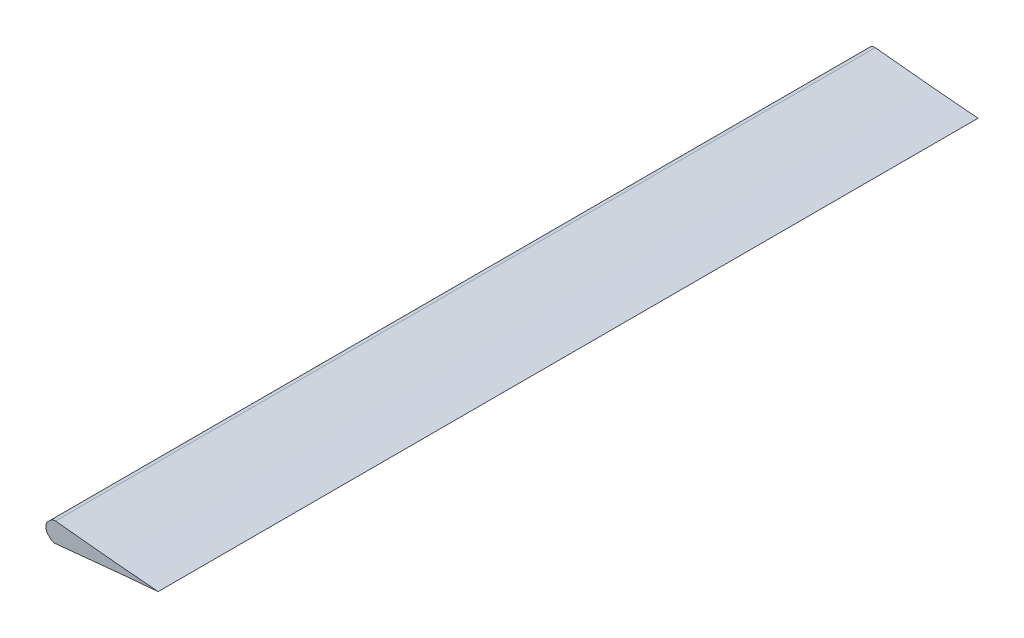
ISO-10303-21;
HEADER;
FILE_DESCRIPTION(('STEP AP214'),'2;1');
FILE_NAME('part.step','',(''),(''),'','','');
FILE_SCHEMA(('AUTOMOTIVE_DESIGN { 1 0 10303 214 1 1 1 1 }'));
ENDSEC;
DATA;
#1=APPLICATION_CONTEXT('core data for automotive mechanical design processes');
#2=APPLICATION_PROTOCOL_DEFINITION('international standard','automotive_design',2000,#1);
#3=PRODUCT_CONTEXT('',#1,'mechanical');
#4=PRODUCT('Part','Part','',(#3));
#5=PRODUCT_RELATED_PRODUCT_CATEGORY('part','',(#4));
#6=PRODUCT_DEFINITION_FORMATION('','',#4);
#7=PRODUCT_DEFINITION_CONTEXT('part definition',#1,'design');
#8=PRODUCT_DEFINITION('design','',#6,#7);
#9=PRODUCT_DEFINITION_SHAPE('','',#8);
#10=(LENGTH_UNIT() NAMED_UNIT(*) SI_UNIT(.MILLI.,.METRE.));
#11=(NAMED_UNIT(*) PLANE_ANGLE_UNIT() SI_UNIT($,.RADIAN.));
#12=(NAMED_UNIT(*) SI_UNIT($,.STERADIAN.) SOLID_ANGLE_UNIT());
#13=UNCERTAINTY_MEASURE_WITH_UNIT(LENGTH_MEASURE(1.E-05),#10,'distance_accuracy_value','');
#14=(GEOMETRIC_REPRESENTATION_CONTEXT(3) GLOBAL_UNCERTAINTY_ASSIGNED_CONTEXT((#13)) GLOBAL_UNIT_ASSIGNED_CONTEXT((#10,
#11,#12)) REPRESENTATION_CONTEXT('',''));
#15=CARTESIAN_POINT('',(0.,0.,0.));
#16=DIRECTION('',(0.,0.,1.));
#17=DIRECTION('',(1.,0.,0.));
#18=AXIS2_PLACEMENT_3D('',#15,#16,#17);
#19=CARTESIAN_POINT('',(234.188,0.,336.55));
#20=CARTESIAN_POINT('',(234.188,0.0155536867371754,336.55));
#21=CARTESIAN_POINT('',(232.462742238016,0.0763011183498608,336.55));
#22=CARTESIAN_POINT('',(230.745266477645,0.292527169730172,336.55));
#23=CARTESIAN_POINT('',(226.677132298683,0.685160998526905,336.55));
#24=CARTESIAN_POINT('',(221.753568546988,1.16400773563211,336.55));
#25=CARTESIAN_POINT('',(215.3729462007,1.68522549167521,336.55));
#26=CARTESIAN_POINT('',(207.860626626306,2.31925472415884,336.55));
#27=CARTESIAN_POINT('',(199.223228450697,3.07964727456537,336.55));
#28=CARTESIAN_POINT('',(189.624917000276,3.97906652208352,336.55));
#29=CARTESIAN_POINT('',(179.198535582012,5.00422639742074,336.55));
#30=CARTESIAN_POINT('',(168.099464270809,6.13682934498714,336.55));
#31=CARTESIAN_POINT('',(156.484959231023,7.35363328315477,336.55));
#32=CARTESIAN_POINT('',(144.512997428575,8.61174271170375,336.55));
#33=CARTESIAN_POINT('',(132.339974156296,9.87166744908778,336.55));
#34=CARTESIAN_POINT('',(120.116467894022,11.0852026217515,336.55));
#35=CARTESIAN_POINT('',(107.983552248755,12.1928122762789,336.55));
#36=CARTESIAN_POINT('',(96.0751169779638,13.1495005255012,336.55));
#37=CARTESIAN_POINT('',(84.511429242941,13.9022961995542,336.55));
#38=CARTESIAN_POINT('',(73.398930657052,14.404277626743,336.55));
#39=CARTESIAN_POINT('',(62.8303659193409,14.6175439004536,336.55));
#40=CARTESIAN_POINT('',(52.8907087007552,14.5288992131145,336.55));
#41=CARTESIAN_POINT('',(43.6527012524977,14.1187806479766,336.55));
#42=CARTESIAN_POINT('',(35.1768696170707,13.3806643516629,336.55));
#43=CARTESIAN_POINT('',(27.5098277844315,12.3176310606149,336.55));
#44=CARTESIAN_POINT('',(20.6924190451798,10.9652625561185,336.55));
#45=CARTESIAN_POINT('',(14.7650412799613,9.38991481063824,336.55));
#46=CARTESIAN_POINT('',(9.76935554134457,7.64375319719279,336.55));
#47=CARTESIAN_POINT('',(5.74944347020792,5.79620776104708,336.55));
#48=CARTESIAN_POINT('',(2.72813684802174,3.87076506472146,336.55));
#49=CARTESIAN_POINT('',(0.75513838257183,2.06686495836958,336.55));
#50=CARTESIAN_POINT('',(-0.307002000670747,0.,336.55));
#51=CARTESIAN_POINT('',(0.75513838257173,-2.06686495836939,336.55));
#52=CARTESIAN_POINT('',(2.72813684802176,-3.8707650647214,336.55));
#53=CARTESIAN_POINT('',(5.74944347020787,-5.7962077610469,336.55));
#54=CARTESIAN_POINT('',(9.76935554134459,-7.64375319719272,336.55));
#55=CARTESIAN_POINT('',(14.7650412799613,-9.38991481063812,336.55));
#56=CARTESIAN_POINT('',(20.6924190451799,-10.9652625561185,336.55));
#57=CARTESIAN_POINT('',(27.5098277844316,-12.3176310606148,336.55));
#58=CARTESIAN_POINT('',(35.1768696170708,-13.3806643516628,336.55));
#59=CARTESIAN_POINT('',(43.6527012524977,-14.1187806479765,336.55));
#60=CARTESIAN_POINT('',(52.8907087007555,-14.5288992131143,336.55));
#61=CARTESIAN_POINT('',(62.8303659193411,-14.6175439004534,336.55));
#62=CARTESIAN_POINT('',(73.3989306570518,-14.404277626743,336.55));
#63=CARTESIAN_POINT('',(84.511429242941,-13.902296199554,336.55));
#64=CARTESIAN_POINT('',(96.0751169779643,-13.1495005255013,336.55));
#65=CARTESIAN_POINT('',(107.983552248755,-12.1928122762789,336.55));
#66=CARTESIAN_POINT('',(120.116467894022,-11.0852026217515,336.55));
#67=CARTESIAN_POINT('',(132.339974156296,-9.87166744908783,336.55));
#68=CARTESIAN_POINT('',(144.512997428573,-8.61174271170374,336.55));
#69=CARTESIAN_POINT('',(156.484959231021,-7.35363328315465,336.55));
#70=CARTESIAN_POINT('',(168.099464270809,-6.13682934498709,336.55));
#71=CARTESIAN_POINT('',(179.198535582013,-5.00422639742061,336.55));
#72=CARTESIAN_POINT('',(189.624917000276,-3.97906652208336,336.55));
#73=CARTESIAN_POINT('',(199.223228450697,-3.07964727456527,336.55));
#74=CARTESIAN_POINT('',(207.860626626305,-2.31925472415887,336.55));
#75=CARTESIAN_POINT('',(215.372946200698,-1.68522549167517,336.55));
#76=CARTESIAN_POINT('',(221.753568546988,-1.16400773563204,336.55));
#77=CARTESIAN_POINT('',(226.677132298683,-0.685160998526885,336.55));
#78=CARTESIAN_POINT('',(230.745266477645,-0.292527169730231,336.55));
#79=CARTESIAN_POINT('',(232.462742238017,-0.0763011183498621,336.55));
#80=CARTESIAN_POINT('',(234.188,-0.0155536867371746,336.55));
#81=CARTESIAN_POINT('',(234.188,0.,336.55));
#82=B_SPLINE_CURVE_WITH_KNOTS('',3,(#19,#20,#21,#22,#23,#24,#25,#26,#27,#28,#29,#30,#31,#32,#33,
#34,#35,#36,#37,#38,#39,#40,#41,#42,#43,#44,#45,#46,#47,#48,#49,#50,#51,#52,#53,#54,#55,#56,#57,
#58,#59,#60,#61,#62,#63,#64,#65,#66,#67,#68,#69,#70,#71,#72,#73,#74,#75,#76,#77,#78,#79,#80,
#81),.UNSPECIFIED.,.T.,.F.,(4,1,1,1,1,1,1,1,1,1,1,1,1,1,1,1,1,1,1,1,1,1,1,1,1,1,1,1,1,1,1,1,1,1,
1,1,1,1,1,1,1,1,1,1,1,1,1,1,1,1,1,1,1,1,1,1,1,1,1,1,4),(0.,0.00172563476379416,
0.00673974483178372,0.0146959592279987,0.0253585857018278,0.0387010036513637,0.0546187297254756,
0.0728670420858862,0.0931742887105951,0.115236170244914,0.138726879481675,0.163314057854661,
0.188652327651034,0.214405506161386,0.24025088202969,0.265875120764067,0.29099755048633,
0.315354755940016,0.338722769262268,0.36092378194178,0.38180167100941,0.401202207986975,
0.419043051856454,0.435268910079612,0.449839477415212,0.462709567314331,0.473798585398369,
0.483060347557168,0.490497732750892,0.496136847068415,0.5,0.503863152931585,0.509502267249108,
0.516939652442832,0.526201414601631,0.537290432685669,0.550160522584788,0.564731089920388,
0.580956948143546,0.598797792013025,0.61819832899059,0.63907621805822,0.661277230737732,
0.684645244059984,0.70900244951367,0.734124879235933,0.75974911797031,0.785594493838614,
0.811347672348966,0.836685942145339,0.861273120518325,0.884763829755086,0.906825711289405,
0.927132957914114,0.945381270274525,0.961298996348636,0.974641414298172,0.985304040772001,
0.993260255168216,0.998274365236206,1.),.UNSPECIFIED.);
#83=DIRECTION('',(0.,0.,-1.));
#84=VECTOR('',#83,1.);
#85=SURFACE_OF_LINEAR_EXTRUSION('',#82,#84);
#86=CARTESIAN_POINT('',(234.188,0.,-336.55));
#87=CARTESIAN_POINT('',(234.188,0.0155536867371754,-336.55));
#88=CARTESIAN_POINT('',(232.462742238016,0.0763011183498608,-336.55));
#89=CARTESIAN_POINT('',(230.745266477645,0.292527169730172,-336.55));
#90=CARTESIAN_POINT('',(226.677132298683,0.685160998526905,-336.55));
#91=CARTESIAN_POINT('',(221.753568546988,1.16400773563211,-336.55));
#92=CARTESIAN_POINT('',(215.3729462007,1.68522549167521,-336.55));
#93=CARTESIAN_POINT('',(207.860626626306,2.31925472415884,-336.55));
#94=CARTESIAN_POINT('',(199.223228450697,3.07964727456537,-336.55));
#95=CARTESIAN_POINT('',(189.624917000276,3.97906652208352,-336.55));
#96=CARTESIAN_POINT('',(179.198535582012,5.00422639742074,-336.55));
#97=CARTESIAN_POINT('',(168.099464270809,6.13682934498714,-336.55));
#98=CARTESIAN_POINT('',(156.484959231023,7.35363328315477,-336.55));
#99=CARTESIAN_POINT('',(144.512997428575,8.61174271170375,-336.55));
#100=CARTESIAN_POINT('',(132.339974156296,9.87166744908778,-336.55));
#101=CARTESIAN_POINT('',(120.116467894022,11.0852026217515,-336.55));
#102=CARTESIAN_POINT('',(107.983552248755,12.1928122762789,-336.55));
#103=CARTESIAN_POINT('',(96.0751169779638,13.1495005255012,-336.55));
#104=CARTESIAN_POINT('',(84.511429242941,13.9022961995542,-336.55));
#105=CARTESIAN_POINT('',(73.398930657052,14.404277626743,-336.55));
#106=CARTESIAN_POINT('',(62.8303659193409,14.6175439004536,-336.55));
#107=CARTESIAN_POINT('',(52.8907087007552,14.5288992131145,-336.55));
#108=CARTESIAN_POINT('',(43.6527012524977,14.1187806479766,-336.55));
#109=CARTESIAN_POINT('',(35.1768696170707,13.3806643516629,-336.55));
#110=CARTESIAN_POINT('',(27.5098277844315,12.3176310606149,-336.55));
#111=CARTESIAN_POINT('',(20.6924190451798,10.9652625561185,-336.55));
#112=CARTESIAN_POINT('',(14.7650412799613,9.38991481063824,-336.55));
#113=CARTESIAN_POINT('',(9.76935554134457,7.64375319719279,-336.55));
#114=CARTESIAN_POINT('',(5.74944347020792,5.79620776104708,-336.55));
#115=CARTESIAN_POINT('',(2.72813684802174,3.87076506472146,-336.55));
#116=CARTESIAN_POINT('',(0.75513838257183,2.06686495836958,-336.55));
#117=CARTESIAN_POINT('',(-0.307002000670747,0.,-336.55));
#118=CARTESIAN_POINT('',(0.75513838257173,-2.06686495836939,-336.55));
#119=CARTESIAN_POINT('',(2.72813684802176,-3.8707650647214,-336.55));
#120=CARTESIAN_POINT('',(5.74944347020787,-5.7962077610469,-336.55));
#121=CARTESIAN_POINT('',(9.76935554134459,-7.64375319719272,-336.55));
#122=CARTESIAN_POINT('',(14.7650412799613,-9.38991481063812,-336.55));
#123=CARTESIAN_POINT('',(20.6924190451799,-10.9652625561185,-336.55));
#124=CARTESIAN_POINT('',(27.5098277844316,-12.3176310606148,-336.55));
#125=CARTESIAN_POINT('',(35.1768696170708,-13.3806643516628,-336.55));
#126=CARTESIAN_POINT('',(43.6527012524977,-14.1187806479765,-336.55));
#127=CARTESIAN_POINT('',(52.8907087007555,-14.5288992131143,-336.55));
#128=CARTESIAN_POINT('',(62.8303659193411,-14.6175439004534,-336.55));
#129=CARTESIAN_POINT('',(73.3989306570518,-14.404277626743,-336.55));
#130=CARTESIAN_POINT('',(84.511429242941,-13.902296199554,-336.55));
#131=CARTESIAN_POINT('',(96.0751169779643,-13.1495005255013,-336.55));
#132=CARTESIAN_POINT('',(107.983552248755,-12.1928122762789,-336.55));
#133=CARTESIAN_POINT('',(120.116467894022,-11.0852026217515,-336.55));
#134=CARTESIAN_POINT('',(132.339974156296,-9.87166744908783,-336.55));
#135=CARTESIAN_POINT('',(144.512997428573,-8.61174271170374,-336.55));
#136=CARTESIAN_POINT('',(156.484959231021,-7.35363328315465,-336.55));
#137=CARTESIAN_POINT('',(168.099464270809,-6.13682934498709,-336.55));
#138=CARTESIAN_POINT('',(179.198535582013,-5.00422639742061,-336.55));
#139=CARTESIAN_POINT('',(189.624917000276,-3.97906652208336,-336.55));
#140=CARTESIAN_POINT('',(199.223228450697,-3.07964727456527,-336.55));
#141=CARTESIAN_POINT('',(207.860626626305,-2.31925472415887,-336.55));
#142=CARTESIAN_POINT('',(215.372946200698,-1.68522549167517,-336.55));
#143=CARTESIAN_POINT('',(221.753568546988,-1.16400773563204,-336.55));
#144=CARTESIAN_POINT('',(226.677132298683,-0.685160998526885,-336.55));
#145=CARTESIAN_POINT('',(230.745266477645,-0.292527169730231,-336.55));
#146=CARTESIAN_POINT('',(232.462742238017,-0.0763011183498621,-336.55));
#147=CARTESIAN_POINT('',(234.188,-0.0155536867371746,-336.55));
#148=CARTESIAN_POINT('',(234.188,0.,-336.55));
#149=B_SPLINE_CURVE_WITH_KNOTS('',3,(#86,#87,#88,#89,#90,#91,#92,#93,#94,#95,#96,#97,#98,#99,
#100,#101,#102,#103,#104,#105,#106,#107,#108,#109,#110,#111,#112,#113,#114,#115,#116,#117,#118,
#119,#120,#121,#122,#123,#124,#125,#126,#127,#128,#129,#130,#131,#132,#133,#134,#135,#136,#137,
#138,#139,#140,#141,#142,#143,#144,#145,#146,#147,#148),.UNSPECIFIED.,.T.,.F.,(4,1,1,1,1,1,1,1,
1,1,1,1,1,1,1,1,1,1,1,1,1,1,1,1,1,1,1,1,1,1,1,1,1,1,1,1,1,1,1,1,1,1,1,1,1,1,1,1,1,1,1,1,1,1,1,1,
1,1,1,1,4),(0.,0.00172563476379416,0.00673974483178372,0.0146959592279987,0.0253585857018278,
0.0387010036513637,0.0546187297254756,0.0728670420858862,0.0931742887105951,0.115236170244914,
0.138726879481675,0.163314057854661,0.188652327651034,0.214405506161386,0.24025088202969,
0.265875120764067,0.29099755048633,0.315354755940016,0.338722769262268,0.36092378194178,
0.38180167100941,0.401202207986975,0.419043051856454,0.435268910079612,0.449839477415212,
0.462709567314331,0.473798585398369,0.483060347557168,0.490497732750892,0.496136847068415,0.5,
0.503863152931585,0.509502267249108,0.516939652442832,0.526201414601631,0.537290432685669,
0.550160522584788,0.564731089920388,0.580956948143546,0.598797792013025,0.61819832899059,
0.63907621805822,0.661277230737732,0.684645244059984,0.70900244951367,0.734124879235933,
0.75974911797031,0.785594493838614,0.811347672348966,0.836685942145339,0.861273120518325,
0.884763829755086,0.906825711289405,0.927132957914114,0.945381270274525,0.961298996348636,
0.974641414298172,0.985304040772001,0.993260255168216,0.998274365236206,1.),.UNSPECIFIED.);
#150=CARTESIAN_POINT('',(149.904539776558,-8.04466785803695,-336.55));
#151=VERTEX_POINT('',#150);
#152=CARTESIAN_POINT('',(149.88896674752,8.04630008600672,-336.55));
#153=VERTEX_POINT('',#152);
#154=EDGE_CURVE('E105',#151,#153,#149,.T.);
#155=ORIENTED_EDGE('',*,*,#154,.T.);
#156=DIRECTION('',(0.,0.,-1.));
#157=VECTOR('',#156,1.);
#158=CARTESIAN_POINT('',(149.88896674752,8.04630008600672,-336.55));
#159=LINE('',#158,#157);
#160=CARTESIAN_POINT('',(149.88896674752,8.04630008600672,336.55));
#161=VERTEX_POINT('',#160);
#162=EDGE_CURVE('E111',#153,#161,#159,.F.);
#163=ORIENTED_EDGE('',*,*,#162,.T.);
#164=CARTESIAN_POINT('',(149.904539776558,-8.04466785803695,336.55));
#165=VERTEX_POINT('',#164);
#166=EDGE_CURVE('E108',#165,#161,#82,.T.);
#167=ORIENTED_EDGE('',*,*,#166,.F.);
#168=DIRECTION('',(0.,0.,-1.));
#169=VECTOR('',#168,1.);
#170=CARTESIAN_POINT('',(149.904539776558,-8.04466785803694,336.55));
#171=LINE('',#170,#169);
#172=EDGE_CURVE('E102',#165,#151,#171,.T.);
#173=ORIENTED_EDGE('',*,*,#172,.T.);
#174=EDGE_LOOP('',(#155,#163,#167,#173));
#175=FACE_BOUND('',#174,.T.);
#176=ADVANCED_FACE('F36',(#175),#85,.F.);
#177=CARTESIAN_POINT('',(0.,0.,336.55));
#178=DIRECTION('',(0.,0.,-1.));
#179=DIRECTION('',(-1.,0.,0.));
#180=AXIS2_PLACEMENT_3D('',#177,#178,#179);
#181=PLANE('',#180);
#182=ORIENTED_EDGE('',*,*,#166,.T.);
#183=CARTESIAN_POINT('',(149.35942884864,2.99397491697312,336.55));
#184=DIRECTION('',(0.,0.,-1.));
#185=DIRECTION('',(-1.,0.,0.));
#186=AXIS2_PLACEMENT_3D('',#183,#184,#185);
#187=CIRCLE('',#186,5.08);
#188=CARTESIAN_POINT('',(145.767326400213,6.58607736540086,336.55));
#189=VERTEX_POINT('',#188);
#190=EDGE_CURVE('E197',#161,#189,#187,.F.);
#191=ORIENTED_EDGE('',*,*,#190,.T.);
#192=DIRECTION('',(0.707106781186557,0.707106781186539,0.));
#193=VECTOR('',#192,1.);
#194=CARTESIAN_POINT('',(69.590624517404,-69.5906245174058,336.55));
#195=LINE('',#194,#193);
#196=CARTESIAN_POINT('',(143.600897551572,4.41964851676048,336.55));
#197=VERTEX_POINT('',#196);
#198=EDGE_CURVE('E147',#197,#189,#195,.T.);
#199=ORIENTED_EDGE('',*,*,#198,.F.);
#200=CARTESIAN_POINT('',(147.193,0.827546068332755,336.55));
#201=DIRECTION('',(0.,0.,-1.));
#202=DIRECTION('',(-1.,0.,0.));
#203=AXIS2_PLACEMENT_3D('',#200,#201,#202);
#204=CIRCLE('',#203,5.08);
#205=CARTESIAN_POINT('',(142.113,0.827546068332715,336.55));
#206=VERTEX_POINT('',#205);
#207=EDGE_CURVE('E146',#197,#206,#204,.F.);
#208=ORIENTED_EDGE('',*,*,#207,.T.);
#209=DIRECTION('',(0.,1.,0.));
#210=VECTOR('',#209,1.);
#211=CARTESIAN_POINT('',(142.113,1.11318642939109E-12,336.55));
#212=LINE('',#211,#210);
#213=CARTESIAN_POINT('',(142.113,-0.810346053983728,336.55));
#214=VERTEX_POINT('',#213);
#215=EDGE_CURVE('E137',#214,#206,#212,.T.);
#216=ORIENTED_EDGE('',*,*,#215,.F.);
#217=CARTESIAN_POINT('',(147.193,-0.810346053983689,336.55));
#218=DIRECTION('',(0.,0.,-1.));
#219=DIRECTION('',(-1.,0.,0.));
#220=AXIS2_PLACEMENT_3D('',#217,#218,#219);
#221=CIRCLE('',#220,5.08);
#222=CARTESIAN_POINT('',(143.600897551572,-4.40244850241142,336.55));
#223=VERTEX_POINT('',#222);
#224=EDGE_CURVE('E143',#214,#223,#221,.F.);
#225=ORIENTED_EDGE('',*,*,#224,.T.);
#226=DIRECTION('',(0.707106781186561,-0.707106781186534,0.));
#227=VECTOR('',#226,1.);
#228=CARTESIAN_POINT('',(69.5992245245776,69.5992245245803,336.55));
#229=LINE('',#228,#227);
#230=CARTESIAN_POINT('',(145.782894683952,-6.58444563479155,336.55));
#231=VERTEX_POINT('',#230);
#232=EDGE_CURVE('E150',#223,#231,#229,.T.);
#233=ORIENTED_EDGE('',*,*,#232,.T.);
#234=CARTESIAN_POINT('',(149.37499713238,-2.9923431863638,336.55));
#235=DIRECTION('',(0.,0.,-1.));
#236=DIRECTION('',(-1.,0.,0.));
#237=AXIS2_PLACEMENT_3D('',#234,#235,#236);
#238=CIRCLE('',#237,5.08);
#239=EDGE_CURVE('E199',#231,#165,#238,.F.);
#240=ORIENTED_EDGE('',*,*,#239,.T.);
#241=EDGE_LOOP('',(#182,#191,#199,#208,#216,#225,#233,#240));
#242=FACE_BOUND('',#241,.T.);
#243=ADVANCED_FACE('F141',(#242),#181,.F.);
#244=CARTESIAN_POINT('',(0.,0.,-336.55));
#245=DIRECTION('',(0.,0.,-1.));
#246=DIRECTION('',(-1.,0.,0.));
#247=AXIS2_PLACEMENT_3D('',#244,#245,#246);
#248=PLANE('',#247);
#249=DIRECTION('',(0.707106781186557,0.707106781186539,0.));
#250=VECTOR('',#249,1.);
#251=CARTESIAN_POINT('',(69.590624517404,-69.5906245174058,-336.55));
#252=LINE('',#251,#250);
#253=CARTESIAN_POINT('',(143.600897551572,4.41964851676048,-336.55));
#254=VERTEX_POINT('',#253);
#255=CARTESIAN_POINT('',(145.767326400213,6.58607736540086,-336.55));
#256=VERTEX_POINT('',#255);
#257=EDGE_CURVE('E186',#254,#256,#252,.T.);
#258=ORIENTED_EDGE('',*,*,#257,.T.);
#259=CARTESIAN_POINT('',(149.35942884864,2.99397491697312,-336.55));
#260=DIRECTION('',(0.,0.,-1.));
#261=DIRECTION('',(-1.,0.,0.));
#262=AXIS2_PLACEMENT_3D('',#259,#260,#261);
#263=CIRCLE('',#262,5.08);
#264=EDGE_CURVE('E118',#256,#153,#263,.T.);
#265=ORIENTED_EDGE('',*,*,#264,.T.);
#266=ORIENTED_EDGE('',*,*,#154,.F.);
#267=CARTESIAN_POINT('',(149.37499713238,-2.9923431863638,-336.55));
#268=DIRECTION('',(0.,0.,-1.));
#269=DIRECTION('',(-1.,0.,0.));
#270=AXIS2_PLACEMENT_3D('',#267,#268,#269);
#271=CIRCLE('',#270,5.08);
#272=CARTESIAN_POINT('',(145.782894683952,-6.58444563479155,-336.55));
#273=VERTEX_POINT('',#272);
#274=EDGE_CURVE('E115',#151,#273,#271,.T.);
#275=ORIENTED_EDGE('',*,*,#274,.T.);
#276=DIRECTION('',(0.707106781186561,-0.707106781186534,0.));
#277=VECTOR('',#276,1.);
#278=CARTESIAN_POINT('',(69.5992245245776,69.5992245245803,-336.55));
#279=LINE('',#278,#277);
#280=CARTESIAN_POINT('',(143.600897551572,-4.40244850241142,-336.55));
#281=VERTEX_POINT('',#280);
#282=EDGE_CURVE('E119',#281,#273,#279,.T.);
#283=ORIENTED_EDGE('',*,*,#282,.F.);
#284=CARTESIAN_POINT('',(147.193,-0.810346053983689,-336.55));
#285=DIRECTION('',(0.,0.,-1.));
#286=DIRECTION('',(-1.,0.,0.));
#287=AXIS2_PLACEMENT_3D('',#284,#285,#286);
#288=CIRCLE('',#287,5.08);
#289=CARTESIAN_POINT('',(142.113,-0.810346053983728,-336.55));
#290=VERTEX_POINT('',#289);
#291=EDGE_CURVE('E56',#281,#290,#288,.T.);
#292=ORIENTED_EDGE('',*,*,#291,.T.);
#293=DIRECTION('',(0.,1.,0.));
#294=VECTOR('',#293,1.);
#295=CARTESIAN_POINT('',(142.113,1.11318642939109E-12,-336.55));
#296=LINE('',#295,#294);
#297=CARTESIAN_POINT('',(142.113,0.827546068332715,-336.55));
#298=VERTEX_POINT('',#297);
#299=EDGE_CURVE('E138',#290,#298,#296,.T.);
#300=ORIENTED_EDGE('',*,*,#299,.T.);
#301=CARTESIAN_POINT('',(147.193,0.827546068332755,-336.55));
#302=DIRECTION('',(0.,0.,-1.));
#303=DIRECTION('',(-1.,0.,0.));
#304=AXIS2_PLACEMENT_3D('',#301,#302,#303);
#305=CIRCLE('',#304,5.08);
#306=EDGE_CURVE('E125',#298,#254,#305,.T.);
#307=ORIENTED_EDGE('',*,*,#306,.T.);
#308=EDGE_LOOP('',(#258,#265,#266,#275,#283,#292,#300,#307));
#309=FACE_BOUND('',#308,.T.);
#310=ADVANCED_FACE('F114',(#309),#248,.T.);
#311=CARTESIAN_POINT('',(142.113,1.11318642939109E-12,-336.55));
#312=DIRECTION('',(1.,0.,0.));
#313=DIRECTION('',(0.,1.,0.));
#314=AXIS2_PLACEMENT_3D('',#311,#312,#313);
#315=PLANE('',#314);
#316=ORIENTED_EDGE('',*,*,#215,.T.);
#317=DIRECTION('',(0.,0.,1.));
#318=VECTOR('',#317,1.);
#319=CARTESIAN_POINT('',(142.113,0.827546068332715,-336.55));
#320=LINE('',#319,#318);
#321=EDGE_CURVE('E11',#206,#298,#320,.F.);
#322=ORIENTED_EDGE('',*,*,#321,.T.);
#323=ORIENTED_EDGE('',*,*,#299,.F.);
#324=DIRECTION('',(0.,0.,1.));
#325=VECTOR('',#324,1.);
#326=CARTESIAN_POINT('',(142.113,-0.810346053983728,336.55));
#327=LINE('',#326,#325);
#328=EDGE_CURVE('E44',#290,#214,#327,.T.);
#329=ORIENTED_EDGE('',*,*,#328,.T.);
#330=EDGE_LOOP('',(#316,#322,#323,#329));
#331=FACE_BOUND('',#330,.T.);
#332=ADVANCED_FACE('F136',(#331),#315,.F.);
#333=CARTESIAN_POINT('',(69.5992245245776,69.5992245245803,-336.55));
#334=DIRECTION('',(-0.707106781186534,-0.707106781186561,0.));
#335=DIRECTION('',(0.707106781186561,-0.707106781186534,0.));
#336=AXIS2_PLACEMENT_3D('',#333,#334,#335);
#337=PLANE('',#336);
#338=ORIENTED_EDGE('',*,*,#282,.T.);
#339=DIRECTION('',(0.,0.,1.));
#340=VECTOR('',#339,1.);
#341=CARTESIAN_POINT('',(145.782894683952,-6.58444563479153,336.55));
#342=LINE('',#341,#340);
#343=EDGE_CURVE('E124',#273,#231,#342,.T.);
#344=ORIENTED_EDGE('',*,*,#343,.T.);
#345=ORIENTED_EDGE('',*,*,#232,.F.);
#346=DIRECTION('',(0.,0.,1.));
#347=VECTOR('',#346,1.);
#348=CARTESIAN_POINT('',(143.600897551572,-4.40244850241142,-336.55));
#349=LINE('',#348,#347);
#350=EDGE_CURVE('E127',#223,#281,#349,.F.);
#351=ORIENTED_EDGE('',*,*,#350,.T.);
#352=EDGE_LOOP('',(#338,#344,#345,#351));
#353=FACE_BOUND('',#352,.T.);
#354=ADVANCED_FACE('F192',(#353),#337,.T.);
#355=CARTESIAN_POINT('',(69.590624517404,-69.5906245174058,-336.55));
#356=DIRECTION('',(0.707106781186539,-0.707106781186557,0.));
#357=DIRECTION('',(0.707106781186557,0.707106781186539,0.));
#358=AXIS2_PLACEMENT_3D('',#355,#356,#357);
#359=PLANE('',#358);
#360=ORIENTED_EDGE('',*,*,#198,.T.);
#361=DIRECTION('',(0.,0.,-1.));
#362=VECTOR('',#361,1.);
#363=CARTESIAN_POINT('',(145.767326400213,6.58607736540086,-336.55));
#364=LINE('',#363,#362);
#365=EDGE_CURVE('E189',#189,#256,#364,.T.);
#366=ORIENTED_EDGE('',*,*,#365,.T.);
#367=ORIENTED_EDGE('',*,*,#257,.F.);
#368=DIRECTION('',(0.,0.,1.));
#369=VECTOR('',#368,1.);
#370=CARTESIAN_POINT('',(143.600897551572,4.41964851676048,-336.55));
#371=LINE('',#370,#369);
#372=EDGE_CURVE('E184',#254,#197,#371,.T.);
#373=ORIENTED_EDGE('',*,*,#372,.T.);
#374=EDGE_LOOP('',(#360,#366,#367,#373));
#375=FACE_BOUND('',#374,.T.);
#376=ADVANCED_FACE('F172',(#375),#359,.F.);
#377=CARTESIAN_POINT('',(149.35942884864,2.99397491697312,0.));
#378=DIRECTION('',(0.,0.,-1.));
#379=DIRECTION('',(-1.,0.,0.));
#380=AXIS2_PLACEMENT_3D('',#377,#378,#379);
#381=CYLINDRICAL_SURFACE('',#380,5.08);
#382=ORIENTED_EDGE('',*,*,#264,.F.);
#383=ORIENTED_EDGE('',*,*,#365,.F.);
#384=ORIENTED_EDGE('',*,*,#190,.F.);
#385=ORIENTED_EDGE('',*,*,#162,.F.);
#386=EDGE_LOOP('',(#382,#383,#384,#385));
#387=FACE_BOUND('',#386,.T.);
#388=ADVANCED_FACE('F169',(#387),#381,.T.);
#389=CARTESIAN_POINT('',(149.37499713238,-2.9923431863638,0.));
#390=DIRECTION('',(0.,0.,-1.));
#391=DIRECTION('',(-1.,0.,0.));
#392=AXIS2_PLACEMENT_3D('',#389,#390,#391);
#393=CYLINDRICAL_SURFACE('',#392,5.08);
#394=ORIENTED_EDGE('',*,*,#274,.F.);
#395=ORIENTED_EDGE('',*,*,#172,.F.);
#396=ORIENTED_EDGE('',*,*,#239,.F.);
#397=ORIENTED_EDGE('',*,*,#343,.F.);
#398=EDGE_LOOP('',(#394,#395,#396,#397));
#399=FACE_BOUND('',#398,.T.);
#400=ADVANCED_FACE('F122',(#399),#393,.T.);
#401=CARTESIAN_POINT('',(147.193,0.827546068332755,-336.55));
#402=DIRECTION('',(0.,0.,1.));
#403=DIRECTION('',(1.,0.,0.));
#404=AXIS2_PLACEMENT_3D('',#401,#402,#403);
#405=CYLINDRICAL_SURFACE('',#404,5.08);
#406=ORIENTED_EDGE('',*,*,#306,.F.);
#407=ORIENTED_EDGE('',*,*,#321,.F.);
#408=ORIENTED_EDGE('',*,*,#207,.F.);
#409=ORIENTED_EDGE('',*,*,#372,.F.);
#410=EDGE_LOOP('',(#406,#407,#408,#409));
#411=FACE_BOUND('',#410,.T.);
#412=ADVANCED_FACE('F175',(#411),#405,.T.);
#413=CARTESIAN_POINT('',(147.193,-0.810346053983689,-336.55));
#414=DIRECTION('',(0.,0.,-1.));
#415=DIRECTION('',(-1.,0.,0.));
#416=AXIS2_PLACEMENT_3D('',#413,#414,#415);
#417=CYLINDRICAL_SURFACE('',#416,5.08);
#418=ORIENTED_EDGE('',*,*,#291,.F.);
#419=ORIENTED_EDGE('',*,*,#350,.F.);
#420=ORIENTED_EDGE('',*,*,#224,.F.);
#421=ORIENTED_EDGE('',*,*,#328,.F.);
#422=EDGE_LOOP('',(#418,#419,#420,#421));
#423=FACE_BOUND('',#422,.T.);
#424=ADVANCED_FACE('F38',(#423),#417,.T.);
#425=CLOSED_SHELL('',(#176,#243,#310,#332,#354,#376,#388,#400,#412,#424));
#426=MANIFOLD_SOLID_BREP('B2',#425);
#427=ADVANCED_BREP_SHAPE_REPRESENTATION('',(#18,#426),#14);
#428=SHAPE_DEFINITION_REPRESENTATION(#9,#427);
ENDSEC;
END-ISO-10303-21;
